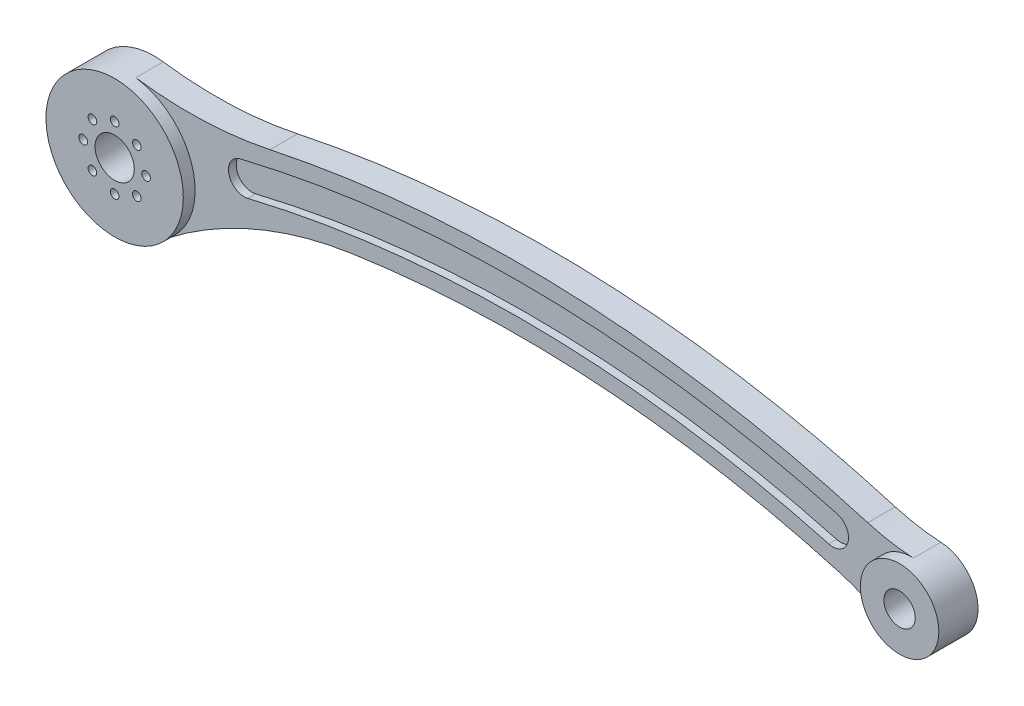
ISO-10303-21;
HEADER;
FILE_DESCRIPTION(('STEP AP214'),'2;1');
FILE_NAME('part.step','',(''),(''),'','','');
FILE_SCHEMA(('AUTOMOTIVE_DESIGN { 1 0 10303 214 1 1 1 1 }'));
ENDSEC;
DATA;
#1=APPLICATION_CONTEXT('core data for automotive mechanical design processes');
#2=APPLICATION_PROTOCOL_DEFINITION('international standard','automotive_design',2000,#1);
#3=PRODUCT_CONTEXT('',#1,'mechanical');
#4=PRODUCT('Part','Part','',(#3));
#5=PRODUCT_RELATED_PRODUCT_CATEGORY('part','',(#4));
#6=PRODUCT_DEFINITION_FORMATION('','',#4);
#7=PRODUCT_DEFINITION_CONTEXT('part definition',#1,'design');
#8=PRODUCT_DEFINITION('design','',#6,#7);
#9=PRODUCT_DEFINITION_SHAPE('','',#8);
#10=(LENGTH_UNIT() NAMED_UNIT(*) SI_UNIT(.MILLI.,.METRE.));
#11=(NAMED_UNIT(*) PLANE_ANGLE_UNIT() SI_UNIT($,.RADIAN.));
#12=(NAMED_UNIT(*) SI_UNIT($,.STERADIAN.) SOLID_ANGLE_UNIT());
#13=UNCERTAINTY_MEASURE_WITH_UNIT(LENGTH_MEASURE(1.E-05),#10,'distance_accuracy_value','');
#14=(GEOMETRIC_REPRESENTATION_CONTEXT(3) GLOBAL_UNCERTAINTY_ASSIGNED_CONTEXT((#13)) GLOBAL_UNIT_ASSIGNED_CONTEXT((#10,
#11,#12)) REPRESENTATION_CONTEXT('',''));
#15=CARTESIAN_POINT('',(0.,0.,0.));
#16=DIRECTION('',(0.,0.,1.));
#17=DIRECTION('',(1.,0.,0.));
#18=AXIS2_PLACEMENT_3D('',#15,#16,#17);
#19=CARTESIAN_POINT('',(150.30166314964,-142.163321762162,10.));
#20=DIRECTION('',(0.,0.,-1.));
#21=DIRECTION('',(-1.,0.,0.));
#22=AXIS2_PLACEMENT_3D('',#19,#20,#21);
#23=PLANE('',#22);
#24=CARTESIAN_POINT('',(0.,8.,10.));
#25=DIRECTION('',(0.,0.,1.));
#26=DIRECTION('',(1.,0.,0.));
#27=AXIS2_PLACEMENT_3D('',#24,#25,#26);
#28=CIRCLE('',#27,1.09999999999999);
#29=CARTESIAN_POINT('',(1.09999999999999,8.,10.));
#30=VERTEX_POINT('',#29);
#31=EDGE_CURVE('E361',#30,#30,#28,.T.);
#32=ORIENTED_EDGE('',*,*,#31,.F.);
#33=EDGE_LOOP('',(#32));
#34=FACE_BOUND('',#33,.T.);
#35=CARTESIAN_POINT('',(5.65685424949248,5.65685424949262,10.));
#36=DIRECTION('',(0.,0.,1.));
#37=DIRECTION('',(1.,0.,0.));
#38=AXIS2_PLACEMENT_3D('',#35,#36,#37);
#39=CIRCLE('',#38,1.09999999999999);
#40=CARTESIAN_POINT('',(6.75685424949247,5.65685424949262,10.));
#41=VERTEX_POINT('',#40);
#42=EDGE_CURVE('E353',#41,#41,#39,.T.);
#43=ORIENTED_EDGE('',*,*,#42,.F.);
#44=EDGE_LOOP('',(#43));
#45=FACE_BOUND('',#44,.T.);
#46=CARTESIAN_POINT('',(8.00000000000034,3.39590937005871E-13,10.));
#47=DIRECTION('',(0.,0.,1.));
#48=DIRECTION('',(1.,0.,0.));
#49=AXIS2_PLACEMENT_3D('',#46,#47,#48);
#50=CIRCLE('',#49,1.09999999999999);
#51=CARTESIAN_POINT('',(9.10000000000033,3.39590937005871E-13,10.));
#52=VERTEX_POINT('',#51);
#53=EDGE_CURVE('E345',#52,#52,#50,.T.);
#54=ORIENTED_EDGE('',*,*,#53,.F.);
#55=EDGE_LOOP('',(#54));
#56=FACE_BOUND('',#55,.T.);
#57=CARTESIAN_POINT('',(6.79181874011743E-13,-8.,10.));
#58=DIRECTION('',(0.,0.,1.));
#59=DIRECTION('',(1.,0.,0.));
#60=AXIS2_PLACEMENT_3D('',#57,#58,#59);
#61=CIRCLE('',#60,1.09999999999999);
#62=CARTESIAN_POINT('',(1.10000000000067,-8.,10.));
#63=VERTEX_POINT('',#62);
#64=EDGE_CURVE('E329',#63,#63,#61,.T.);
#65=ORIENTED_EDGE('',*,*,#64,.F.);
#66=EDGE_LOOP('',(#65));
#67=FACE_BOUND('',#66,.T.);
#68=CARTESIAN_POINT('',(-5.6568542494918,-5.65685424949262,10.));
#69=DIRECTION('',(0.,0.,1.));
#70=DIRECTION('',(1.,0.,0.));
#71=AXIS2_PLACEMENT_3D('',#68,#69,#70);
#72=CIRCLE('',#71,1.09999999999999);
#73=CARTESIAN_POINT('',(-4.55685424949181,-5.65685424949262,10.));
#74=VERTEX_POINT('',#73);
#75=EDGE_CURVE('E321',#74,#74,#72,.T.);
#76=ORIENTED_EDGE('',*,*,#75,.F.);
#77=EDGE_LOOP('',(#76));
#78=FACE_BOUND('',#77,.T.);
#79=CARTESIAN_POINT('',(-7.99999999999966,-3.40570654445189E-13,10.));
#80=DIRECTION('',(0.,0.,1.));
#81=DIRECTION('',(1.,0.,0.));
#82=AXIS2_PLACEMENT_3D('',#79,#80,#81);
#83=CIRCLE('',#82,1.09999999999999);
#84=CARTESIAN_POINT('',(-6.89999999999967,-3.40570654445189E-13,10.));
#85=VERTEX_POINT('',#84);
#86=EDGE_CURVE('E313',#85,#85,#83,.T.);
#87=ORIENTED_EDGE('',*,*,#86,.F.);
#88=EDGE_LOOP('',(#87));
#89=FACE_BOUND('',#88,.T.);
#90=CARTESIAN_POINT('',(-5.65685424949228,5.65685424949214,10.));
#91=DIRECTION('',(0.,0.,1.));
#92=DIRECTION('',(1.,0.,0.));
#93=AXIS2_PLACEMENT_3D('',#90,#91,#92);
#94=CIRCLE('',#93,1.09999999999999);
#95=CARTESIAN_POINT('',(-4.55685424949229,5.65685424949214,10.));
#96=VERTEX_POINT('',#95);
#97=EDGE_CURVE('E306',#96,#96,#94,.T.);
#98=ORIENTED_EDGE('',*,*,#97,.F.);
#99=EDGE_LOOP('',(#98));
#100=FACE_BOUND('',#99,.T.);
#101=CARTESIAN_POINT('',(0.,0.,10.));
#102=DIRECTION('',(0.,0.,1.));
#103=DIRECTION('',(1.,0.,0.));
#104=AXIS2_PLACEMENT_3D('',#101,#102,#103);
#105=CIRCLE('',#104,5.);
#106=CARTESIAN_POINT('',(5.,0.,10.));
#107=VERTEX_POINT('',#106);
#108=EDGE_CURVE('E242',#107,#107,#105,.T.);
#109=ORIENTED_EDGE('',*,*,#108,.F.);
#110=EDGE_LOOP('',(#109));
#111=FACE_BOUND('',#110,.T.);
#112=CARTESIAN_POINT('',(0.,0.,10.));
#113=DIRECTION('',(0.,0.,1.));
#114=DIRECTION('',(1.,0.,0.));
#115=AXIS2_PLACEMENT_3D('',#112,#113,#114);
#116=CIRCLE('',#115,17.5);
#117=CARTESIAN_POINT('',(17.5,0.,10.));
#118=VERTEX_POINT('',#117);
#119=EDGE_CURVE('E185',#118,#118,#116,.T.);
#120=ORIENTED_EDGE('',*,*,#119,.T.);
#121=EDGE_LOOP('',(#120));
#122=FACE_BOUND('',#121,.T.);
#123=CARTESIAN_POINT('',(5.65685424949296,-5.65685424949214,10.));
#124=DIRECTION('',(0.,0.,1.));
#125=DIRECTION('',(1.,0.,0.));
#126=AXIS2_PLACEMENT_3D('',#123,#124,#125);
#127=CIRCLE('',#126,1.09999999999999);
#128=CARTESIAN_POINT('',(6.75685424949295,-5.65685424949214,10.));
#129=VERTEX_POINT('',#128);
#130=EDGE_CURVE('E337',#129,#129,#127,.T.);
#131=ORIENTED_EDGE('',*,*,#130,.F.);
#132=EDGE_LOOP('',(#131));
#133=FACE_BOUND('',#132,.T.);
#134=ADVANCED_FACE('F40',(#34,#45,#56,#67,#78,#89,#100,#111,#122,#133),#23,.F.);
#135=CARTESIAN_POINT('',(179.999550740558,6.62602105160044,10.));
#136=DIRECTION('',(0.,0.,-1.));
#137=DIRECTION('',(-1.,0.,0.));
#138=AXIS2_PLACEMENT_3D('',#135,#136,#137);
#139=CYLINDRICAL_SURFACE('',#138,4.);
#140=DIRECTION('',(0.,0.,-1.));
#141=VECTOR('',#140,1.);
#142=CARTESIAN_POINT('',(178.947951069275,2.76672861238847,10.));
#143=LINE('',#142,#141);
#144=CARTESIAN_POINT('',(178.947951069275,2.76672861238847,7.));
#145=VERTEX_POINT('',#144);
#146=CARTESIAN_POINT('',(178.947951069275,2.7667286123885,5.));
#147=VERTEX_POINT('',#146);
#148=EDGE_CURVE('E259',#145,#147,#143,.T.);
#149=ORIENTED_EDGE('',*,*,#148,.F.);
#150=CARTESIAN_POINT('',(179.999550740558,6.62602105160044,7.));
#151=DIRECTION('',(0.,0.,1.));
#152=DIRECTION('',(1.,0.,0.));
#153=AXIS2_PLACEMENT_3D('',#150,#151,#152);
#154=CIRCLE('',#153,4.);
#155=CARTESIAN_POINT('',(181.05115041184,10.4853134908123,7.));
#156=VERTEX_POINT('',#155);
#157=EDGE_CURVE('E56',#145,#156,#154,.T.);
#158=ORIENTED_EDGE('',*,*,#157,.T.);
#159=DIRECTION('',(0.,0.,-1.));
#160=VECTOR('',#159,1.);
#161=CARTESIAN_POINT('',(181.05115041184,10.4853134908123,10.));
#162=LINE('',#161,#160);
#163=CARTESIAN_POINT('',(181.05115041184,10.4853134908123,5.));
#164=VERTEX_POINT('',#163);
#165=EDGE_CURVE('E248',#156,#164,#162,.T.);
#166=ORIENTED_EDGE('',*,*,#165,.T.);
#167=CARTESIAN_POINT('',(179.999550740558,6.62602105160044,5.));
#168=DIRECTION('',(0.,0.,-1.));
#169=DIRECTION('',(-1.,0.,0.));
#170=AXIS2_PLACEMENT_3D('',#167,#168,#169);
#171=CIRCLE('',#170,4.);
#172=EDGE_CURVE('E261',#164,#147,#171,.T.);
#173=ORIENTED_EDGE('',*,*,#172,.T.);
#174=EDGE_LOOP('',(#149,#158,#166,#173));
#175=FACE_BOUND('',#174,.T.);
#176=ADVANCED_FACE('F371',(#175),#139,.F.);
#177=CARTESIAN_POINT('',(100.603775558723,-284.7505581089,10.));
#178=DIRECTION('',(0.,0.,-1.));
#179=DIRECTION('',(-1.,0.,0.));
#180=AXIS2_PLACEMENT_3D('',#177,#178,#179);
#181=CYLINDRICAL_SURFACE('',#180,306.);
#182=ORIENTED_EDGE('',*,*,#165,.F.);
#183=CARTESIAN_POINT('',(100.603775558723,-284.7505581089,7.));
#184=DIRECTION('',(0.,0.,1.));
#185=DIRECTION('',(1.,0.,0.));
#186=AXIS2_PLACEMENT_3D('',#183,#184,#185);
#187=CIRCLE('',#186,306.);
#188=CARTESIAN_POINT('',(29.0648506548514,12.7694953725386,7.));
#189=VERTEX_POINT('',#188);
#190=EDGE_CURVE('E279',#156,#189,#187,.T.);
#191=ORIENTED_EDGE('',*,*,#190,.T.);
#192=DIRECTION('',(0.,0.,-1.));
#193=VECTOR('',#192,1.);
#194=CARTESIAN_POINT('',(29.0648506548514,12.7694953725386,10.));
#195=LINE('',#194,#193);
#196=CARTESIAN_POINT('',(29.0648506548514,12.7694953725386,5.));
#197=VERTEX_POINT('',#196);
#198=EDGE_CURVE('E253',#189,#197,#195,.T.);
#199=ORIENTED_EDGE('',*,*,#198,.T.);
#200=CARTESIAN_POINT('',(100.603775558723,-284.7505581089,5.));
#201=DIRECTION('',(0.,0.,-1.));
#202=DIRECTION('',(-1.,0.,0.));
#203=AXIS2_PLACEMENT_3D('',#200,#201,#202);
#204=CIRCLE('',#203,306.);
#205=EDGE_CURVE('E265',#197,#164,#204,.T.);
#206=ORIENTED_EDGE('',*,*,#205,.T.);
#207=EDGE_LOOP('',(#182,#191,#199,#206));
#208=FACE_BOUND('',#207,.T.);
#209=ADVANCED_FACE('F635',(#208),#181,.F.);
#210=CARTESIAN_POINT('',(30.,8.88034434663747,10.));
#211=DIRECTION('',(0.,0.,-1.));
#212=DIRECTION('',(-1.,0.,0.));
#213=AXIS2_PLACEMENT_3D('',#210,#211,#212);
#214=CYLINDRICAL_SURFACE('',#213,3.99999999999999);
#215=ORIENTED_EDGE('',*,*,#198,.F.);
#216=CARTESIAN_POINT('',(30.,8.88034434663747,7.));
#217=DIRECTION('',(0.,0.,1.));
#218=DIRECTION('',(1.,0.,0.));
#219=AXIS2_PLACEMENT_3D('',#216,#217,#218);
#220=CIRCLE('',#219,3.99999999999999);
#221=CARTESIAN_POINT('',(30.9351493451486,4.99119332073633,7.));
#222=VERTEX_POINT('',#221);
#223=EDGE_CURVE('E282',#189,#222,#220,.T.);
#224=ORIENTED_EDGE('',*,*,#223,.T.);
#225=DIRECTION('',(0.,0.,-1.));
#226=VECTOR('',#225,1.);
#227=CARTESIAN_POINT('',(30.9351493451486,4.99119332073633,10.));
#228=LINE('',#227,#226);
#229=CARTESIAN_POINT('',(30.9351493451486,4.99119332073633,5.));
#230=VERTEX_POINT('',#229);
#231=EDGE_CURVE('E256',#222,#230,#228,.T.);
#232=ORIENTED_EDGE('',*,*,#231,.T.);
#233=CARTESIAN_POINT('',(30.,8.88034434663747,5.));
#234=DIRECTION('',(0.,0.,-1.));
#235=DIRECTION('',(-1.,0.,0.));
#236=AXIS2_PLACEMENT_3D('',#233,#234,#235);
#237=CIRCLE('',#236,3.99999999999998);
#238=EDGE_CURVE('E269',#230,#197,#237,.T.);
#239=ORIENTED_EDGE('',*,*,#238,.T.);
#240=EDGE_LOOP('',(#215,#224,#232,#239));
#241=FACE_BOUND('',#240,.T.);
#242=ADVANCED_FACE('F625',(#241),#214,.F.);
#243=CARTESIAN_POINT('',(100.603775558723,-284.7505581089,10.));
#244=DIRECTION('',(0.,0.,-1.));
#245=DIRECTION('',(-1.,0.,0.));
#246=AXIS2_PLACEMENT_3D('',#243,#244,#245);
#247=CYLINDRICAL_SURFACE('',#246,298.);
#248=ORIENTED_EDGE('',*,*,#231,.F.);
#249=CARTESIAN_POINT('',(100.603775558723,-284.7505581089,7.));
#250=DIRECTION('',(0.,0.,1.));
#251=DIRECTION('',(1.,0.,0.));
#252=AXIS2_PLACEMENT_3D('',#249,#250,#251);
#253=CIRCLE('',#252,298.);
#254=EDGE_CURVE('E286',#222,#145,#253,.F.);
#255=ORIENTED_EDGE('',*,*,#254,.T.);
#256=ORIENTED_EDGE('',*,*,#148,.T.);
#257=CARTESIAN_POINT('',(100.603775558723,-284.7505581089,5.));
#258=DIRECTION('',(0.,0.,1.));
#259=DIRECTION('',(-1.,0.,0.));
#260=AXIS2_PLACEMENT_3D('',#257,#258,#259);
#261=CIRCLE('',#260,298.);
#262=EDGE_CURVE('E273',#147,#230,#261,.T.);
#263=ORIENTED_EDGE('',*,*,#262,.T.);
#264=EDGE_LOOP('',(#248,#255,#256,#263));
#265=FACE_BOUND('',#264,.T.);
#266=ADVANCED_FACE('F620',(#265),#247,.T.);
#267=CARTESIAN_POINT('',(140.30166314964,-139.06226852865,5.));
#268=DIRECTION('',(0.,0.,-1.));
#269=DIRECTION('',(-1.,0.,0.));
#270=AXIS2_PLACEMENT_3D('',#267,#268,#269);
#271=PLANE('',#270);
#272=ORIENTED_EDGE('',*,*,#262,.F.);
#273=ORIENTED_EDGE('',*,*,#172,.F.);
#274=ORIENTED_EDGE('',*,*,#205,.F.);
#275=ORIENTED_EDGE('',*,*,#238,.F.);
#276=EDGE_LOOP('',(#272,#273,#274,#275));
#277=FACE_BOUND('',#276,.T.);
#278=ADVANCED_FACE('F613',(#277),#271,.F.);
#279=CARTESIAN_POINT('',(134.175744006113,-167.460648335862,7.));
#280=DIRECTION('',(0.,0.,1.));
#281=DIRECTION('',(1.,0.,0.));
#282=AXIS2_PLACEMENT_3D('',#279,#280,#281);
#283=PLANE('',#282);
#284=ORIENTED_EDGE('',*,*,#254,.F.);
#285=ORIENTED_EDGE('',*,*,#223,.F.);
#286=ORIENTED_EDGE('',*,*,#190,.F.);
#287=ORIENTED_EDGE('',*,*,#157,.F.);
#288=EDGE_LOOP('',(#284,#285,#286,#287));
#289=FACE_BOUND('',#288,.T.);
#290=CARTESIAN_POINT('',(167.747712453503,-50.1707385628238,7.));
#291=DIRECTION('',(0.,0.,-1.));
#292=DIRECTION('',(1.,0.,0.));
#293=AXIS2_PLACEMENT_3D('',#290,#291,#292);
#294=CIRCLE('',#293,50.);
#295=CARTESIAN_POINT('',(181.506715915548,-2.10110340993941,7.));
#296=VERTEX_POINT('',#295);
#297=CARTESIAN_POINT('',(194.624244359382,-8.00852760665749,7.));
#298=VERTEX_POINT('',#297);
#299=EDGE_CURVE('E138',#296,#298,#294,.T.);
#300=ORIENTED_EDGE('',*,*,#299,.T.);
#301=CARTESIAN_POINT('',(199.999550740558,0.423914584575795,7.));
#302=DIRECTION('',(0.,0.,-1.));
#303=DIRECTION('',(1.,0.,0.));
#304=AXIS2_PLACEMENT_3D('',#301,#302,#303);
#305=CIRCLE('',#304,10.);
#306=CARTESIAN_POINT('',(200.520666376203,10.4103272785459,7.));
#307=VERTEX_POINT('',#306);
#308=EDGE_CURVE('E64',#298,#307,#305,.T.);
#309=ORIENTED_EDGE('',*,*,#308,.T.);
#310=CARTESIAN_POINT('',(203.12624455443,60.3423907483957,7.));
#311=DIRECTION('',(0.,0.,-1.));
#312=DIRECTION('',(1.,0.,0.));
#313=AXIS2_PLACEMENT_3D('',#310,#311,#312);
#314=CIRCLE('',#313,49.9999999999997);
#315=CARTESIAN_POINT('',(188.887012749471,12.412814518216,7.));
#316=VERTEX_POINT('',#315);
#317=EDGE_CURVE('E137',#307,#316,#314,.T.);
#318=ORIENTED_EDGE('',*,*,#317,.T.);
#319=CARTESIAN_POINT('',(100.603775558723,-284.7505581089,7.));
#320=DIRECTION('',(0.,0.,1.));
#321=DIRECTION('',(1.,0.,0.));
#322=AXIS2_PLACEMENT_3D('',#319,#320,#321);
#323=CIRCLE('',#322,310.);
#324=CARTESIAN_POINT('',(36.5918000330634,18.5685263373352,7.));
#325=VERTEX_POINT('',#324);
#326=EDGE_CURVE('E223',#316,#325,#323,.T.);
#327=ORIENTED_EDGE('',*,*,#326,.T.);
#328=CARTESIAN_POINT('',(15.9427756699475,116.413392287734,7.));
#329=DIRECTION('',(0.,0.,-1.));
#330=DIRECTION('',(1.,0.,0.));
#331=AXIS2_PLACEMENT_3D('',#328,#329,#330);
#332=CIRCLE('',#331,100.);
#333=CARTESIAN_POINT('',(2.37445595084322,17.3381648088114,7.));
#334=VERTEX_POINT('',#333);
#335=EDGE_CURVE('E219',#325,#334,#332,.T.);
#336=ORIENTED_EDGE('',*,*,#335,.T.);
#337=CARTESIAN_POINT('',(0.,0.,7.));
#338=DIRECTION('',(0.,0.,-1.));
#339=DIRECTION('',(1.,0.,0.));
#340=AXIS2_PLACEMENT_3D('',#337,#338,#339);
#341=CIRCLE('',#340,17.5);
#342=CARTESIAN_POINT('',(10.7198895078001,-13.8323522562346,7.));
#343=VERTEX_POINT('',#342);
#344=EDGE_CURVE('E294',#334,#343,#341,.T.);
#345=ORIENTED_EDGE('',*,*,#344,.T.);
#346=CARTESIAN_POINT('',(71.9764009809434,-92.8743651490036,7.));
#347=DIRECTION('',(0.,0.,-1.));
#348=DIRECTION('',(1.,0.,0.));
#349=AXIS2_PLACEMENT_3D('',#346,#347,#348);
#350=CIRCLE('',#349,99.9999999999999);
#351=CARTESIAN_POINT('',(57.2200223326035,6.03088895403593,7.));
#352=VERTEX_POINT('',#351);
#353=EDGE_CURVE('E291',#343,#352,#350,.T.);
#354=ORIENTED_EDGE('',*,*,#353,.T.);
#355=CARTESIAN_POINT('',(100.603775558723,-284.7505581089,7.));
#356=DIRECTION('',(0.,0.,-1.));
#357=DIRECTION('',(1.,0.,0.));
#358=AXIS2_PLACEMENT_3D('',#355,#356,#357);
#359=CIRCLE('',#358,294.);
#360=EDGE_CURVE('E143',#352,#296,#359,.T.);
#361=ORIENTED_EDGE('',*,*,#360,.T.);
#362=EDGE_LOOP('',(#300,#309,#318,#327,#336,#345,#354,#361));
#363=FACE_BOUND('',#362,.T.);
#364=ADVANCED_FACE('F141',(#289,#363),#283,.T.);
#365=CARTESIAN_POINT('',(0.,0.,10.));
#366=DIRECTION('',(0.,0.,-1.));
#367=DIRECTION('',(-1.,0.,0.));
#368=AXIS2_PLACEMENT_3D('',#365,#366,#367);
#369=CYLINDRICAL_SURFACE('',#368,5.);
#370=ORIENTED_EDGE('',*,*,#108,.T.);
#371=EDGE_LOOP('',(#370));
#372=FACE_BOUND('',#371,.T.);
#373=CARTESIAN_POINT('',(0.,0.,0.));
#374=DIRECTION('',(0.,0.,1.));
#375=DIRECTION('',(1.,0.,0.));
#376=AXIS2_PLACEMENT_3D('',#373,#374,#375);
#377=CIRCLE('',#376,5.);
#378=CARTESIAN_POINT('',(5.,0.,0.));
#379=VERTEX_POINT('',#378);
#380=EDGE_CURVE('E244',#379,#379,#377,.T.);
#381=ORIENTED_EDGE('',*,*,#380,.F.);
#382=EDGE_LOOP('',(#381));
#383=FACE_BOUND('',#382,.T.);
#384=ADVANCED_FACE('F416',(#372,#383),#369,.F.);
#385=CARTESIAN_POINT('',(199.999550740558,0.423914584575795,10.));
#386=DIRECTION('',(0.,0.,-1.));
#387=DIRECTION('',(-1.,0.,0.));
#388=AXIS2_PLACEMENT_3D('',#385,#386,#387);
#389=CYLINDRICAL_SURFACE('',#388,3.99999999999999);
#390=CARTESIAN_POINT('',(199.999550740558,0.423914584575795,10.));
#391=DIRECTION('',(0.,0.,1.));
#392=DIRECTION('',(1.,0.,0.));
#393=AXIS2_PLACEMENT_3D('',#390,#391,#392);
#394=CIRCLE('',#393,3.99999999999999);
#395=CARTESIAN_POINT('',(203.999550740558,0.423914584575795,10.));
#396=VERTEX_POINT('',#395);
#397=EDGE_CURVE('E227',#396,#396,#394,.T.);
#398=ORIENTED_EDGE('',*,*,#397,.T.);
#399=EDGE_LOOP('',(#398));
#400=FACE_BOUND('',#399,.T.);
#401=CARTESIAN_POINT('',(199.999550740558,0.423914584575795,0.));
#402=DIRECTION('',(0.,0.,1.));
#403=DIRECTION('',(1.,0.,0.));
#404=AXIS2_PLACEMENT_3D('',#401,#402,#403);
#405=CIRCLE('',#404,3.99999999999999);
#406=CARTESIAN_POINT('',(203.999550740558,0.423914584575795,0.));
#407=VERTEX_POINT('',#406);
#408=EDGE_CURVE('E231',#407,#407,#405,.T.);
#409=ORIENTED_EDGE('',*,*,#408,.F.);
#410=EDGE_LOOP('',(#409));
#411=FACE_BOUND('',#410,.T.);
#412=ADVANCED_FACE('F402',(#400,#411),#389,.F.);
#413=CARTESIAN_POINT('',(150.30166314964,-142.163321762162,0.));
#414=DIRECTION('',(0.,0.,-1.));
#415=DIRECTION('',(-1.,0.,0.));
#416=AXIS2_PLACEMENT_3D('',#413,#414,#415);
#417=PLANE('',#416);
#418=CARTESIAN_POINT('',(0.,8.,0.));
#419=DIRECTION('',(0.,0.,-1.));
#420=DIRECTION('',(-1.,0.,0.));
#421=AXIS2_PLACEMENT_3D('',#418,#419,#420);
#422=CIRCLE('',#421,1.09999999999999);
#423=CARTESIAN_POINT('',(-1.09999999999999,8.,0.));
#424=VERTEX_POINT('',#423);
#425=EDGE_CURVE('E357',#424,#424,#422,.T.);
#426=ORIENTED_EDGE('',*,*,#425,.F.);
#427=EDGE_LOOP('',(#426));
#428=FACE_BOUND('',#427,.T.);
#429=CARTESIAN_POINT('',(5.65685424949248,5.65685424949262,0.));
#430=DIRECTION('',(0.,0.,-1.));
#431=DIRECTION('',(-1.,0.,0.));
#432=AXIS2_PLACEMENT_3D('',#429,#430,#431);
#433=CIRCLE('',#432,1.09999999999999);
#434=CARTESIAN_POINT('',(4.55685424949249,5.65685424949262,0.));
#435=VERTEX_POINT('',#434);
#436=EDGE_CURVE('E349',#435,#435,#433,.T.);
#437=ORIENTED_EDGE('',*,*,#436,.F.);
#438=EDGE_LOOP('',(#437));
#439=FACE_BOUND('',#438,.T.);
#440=CARTESIAN_POINT('',(8.00000000000034,3.39590937005871E-13,0.));
#441=DIRECTION('',(0.,0.,-1.));
#442=DIRECTION('',(-1.,0.,0.));
#443=AXIS2_PLACEMENT_3D('',#440,#441,#442);
#444=CIRCLE('',#443,1.09999999999999);
#445=CARTESIAN_POINT('',(6.90000000000035,3.39590937005871E-13,0.));
#446=VERTEX_POINT('',#445);
#447=EDGE_CURVE('E341',#446,#446,#444,.T.);
#448=ORIENTED_EDGE('',*,*,#447,.F.);
#449=EDGE_LOOP('',(#448));
#450=FACE_BOUND('',#449,.T.);
#451=CARTESIAN_POINT('',(5.65685424949296,-5.65685424949214,0.));
#452=DIRECTION('',(0.,0.,-1.));
#453=DIRECTION('',(-1.,0.,0.));
#454=AXIS2_PLACEMENT_3D('',#451,#452,#453);
#455=CIRCLE('',#454,1.09999999999999);
#456=CARTESIAN_POINT('',(4.55685424949297,-5.65685424949214,0.));
#457=VERTEX_POINT('',#456);
#458=EDGE_CURVE('E333',#457,#457,#455,.T.);
#459=ORIENTED_EDGE('',*,*,#458,.F.);
#460=EDGE_LOOP('',(#459));
#461=FACE_BOUND('',#460,.T.);
#462=CARTESIAN_POINT('',(6.79181874011743E-13,-8.,0.));
#463=DIRECTION('',(0.,0.,-1.));
#464=DIRECTION('',(-1.,0.,0.));
#465=AXIS2_PLACEMENT_3D('',#462,#463,#464);
#466=CIRCLE('',#465,1.09999999999999);
#467=CARTESIAN_POINT('',(-1.09999999999931,-8.,0.));
#468=VERTEX_POINT('',#467);
#469=EDGE_CURVE('E325',#468,#468,#466,.T.);
#470=ORIENTED_EDGE('',*,*,#469,.F.);
#471=EDGE_LOOP('',(#470));
#472=FACE_BOUND('',#471,.T.);
#473=CARTESIAN_POINT('',(-5.6568542494918,-5.65685424949262,0.));
#474=DIRECTION('',(0.,0.,-1.));
#475=DIRECTION('',(-1.,0.,0.));
#476=AXIS2_PLACEMENT_3D('',#473,#474,#475);
#477=CIRCLE('',#476,1.09999999999999);
#478=CARTESIAN_POINT('',(-6.75685424949179,-5.65685424949262,0.));
#479=VERTEX_POINT('',#478);
#480=EDGE_CURVE('E317',#479,#479,#477,.T.);
#481=ORIENTED_EDGE('',*,*,#480,.F.);
#482=EDGE_LOOP('',(#481));
#483=FACE_BOUND('',#482,.T.);
#484=CARTESIAN_POINT('',(-7.99999999999966,-3.40570654445189E-13,0.));
#485=DIRECTION('',(0.,0.,-1.));
#486=DIRECTION('',(-1.,0.,0.));
#487=AXIS2_PLACEMENT_3D('',#484,#485,#486);
#488=CIRCLE('',#487,1.09999999999999);
#489=CARTESIAN_POINT('',(-9.09999999999966,-3.40570654445189E-13,0.));
#490=VERTEX_POINT('',#489);
#491=EDGE_CURVE('E310',#490,#490,#488,.T.);
#492=ORIENTED_EDGE('',*,*,#491,.F.);
#493=EDGE_LOOP('',(#492));
#494=FACE_BOUND('',#493,.T.);
#495=CARTESIAN_POINT('',(-5.65685424949228,5.65685424949214,0.));
#496=DIRECTION('',(0.,0.,-1.));
#497=DIRECTION('',(-1.,0.,0.));
#498=AXIS2_PLACEMENT_3D('',#495,#496,#497);
#499=CIRCLE('',#498,1.09999999999999);
#500=CARTESIAN_POINT('',(-6.75685424949227,5.65685424949214,0.));
#501=VERTEX_POINT('',#500);
#502=EDGE_CURVE('E148',#501,#501,#499,.T.);
#503=ORIENTED_EDGE('',*,*,#502,.F.);
#504=EDGE_LOOP('',(#503));
#505=FACE_BOUND('',#504,.T.);
#506=ORIENTED_EDGE('',*,*,#408,.T.);
#507=EDGE_LOOP('',(#506));
#508=FACE_BOUND('',#507,.T.);
#509=CARTESIAN_POINT('',(100.603775558723,-284.7505581089,0.));
#510=DIRECTION('',(0.,0.,1.));
#511=DIRECTION('',(-1.,0.,0.));
#512=AXIS2_PLACEMENT_3D('',#509,#510,#511);
#513=CIRCLE('',#512,310.);
#514=CARTESIAN_POINT('',(188.887012749471,12.4128145182157,0.));
#515=VERTEX_POINT('',#514);
#516=CARTESIAN_POINT('',(36.5918000330634,18.5685263373351,0.));
#517=VERTEX_POINT('',#516);
#518=EDGE_CURVE('E189',#515,#517,#513,.T.);
#519=ORIENTED_EDGE('',*,*,#518,.F.);
#520=CARTESIAN_POINT('',(203.12624455443,60.3423907483957,0.));
#521=DIRECTION('',(0.,0.,-1.));
#522=DIRECTION('',(-1.,0.,0.));
#523=AXIS2_PLACEMENT_3D('',#520,#521,#522);
#524=CIRCLE('',#523,50.);
#525=CARTESIAN_POINT('',(200.520666376203,10.4103272785459,0.));
#526=VERTEX_POINT('',#525);
#527=EDGE_CURVE('E11',#515,#526,#524,.F.);
#528=ORIENTED_EDGE('',*,*,#527,.T.);
#529=CARTESIAN_POINT('',(199.999550740558,0.423914584575795,0.));
#530=DIRECTION('',(0.,0.,1.));
#531=DIRECTION('',(1.,0.,0.));
#532=AXIS2_PLACEMENT_3D('',#529,#530,#531);
#533=CIRCLE('',#532,10.);
#534=CARTESIAN_POINT('',(194.624244359382,-8.0085276066575,0.));
#535=VERTEX_POINT('',#534);
#536=EDGE_CURVE('E175',#535,#526,#533,.T.);
#537=ORIENTED_EDGE('',*,*,#536,.F.);
#538=CARTESIAN_POINT('',(167.747712453503,-50.1707385628238,0.));
#539=DIRECTION('',(0.,0.,-1.));
#540=DIRECTION('',(-1.,0.,0.));
#541=AXIS2_PLACEMENT_3D('',#538,#539,#540);
#542=CIRCLE('',#541,50.);
#543=CARTESIAN_POINT('',(181.506715915548,-2.10110340993935,0.));
#544=VERTEX_POINT('',#543);
#545=EDGE_CURVE('E49',#535,#544,#542,.F.);
#546=ORIENTED_EDGE('',*,*,#545,.T.);
#547=CARTESIAN_POINT('',(100.603775558723,-284.7505581089,0.));
#548=DIRECTION('',(0.,0.,-1.));
#549=DIRECTION('',(-1.,0.,0.));
#550=AXIS2_PLACEMENT_3D('',#547,#548,#549);
#551=CIRCLE('',#550,294.);
#552=CARTESIAN_POINT('',(57.2200223326035,6.03088895403603,0.));
#553=VERTEX_POINT('',#552);
#554=EDGE_CURVE('E174',#553,#544,#551,.T.);
#555=ORIENTED_EDGE('',*,*,#554,.F.);
#556=CARTESIAN_POINT('',(71.9764009809434,-92.8743651490036,0.));
#557=DIRECTION('',(0.,0.,-1.));
#558=DIRECTION('',(-1.,0.,0.));
#559=AXIS2_PLACEMENT_3D('',#556,#557,#558);
#560=CIRCLE('',#559,100.);
#561=CARTESIAN_POINT('',(10.7198895078001,-13.8323522562346,0.));
#562=VERTEX_POINT('',#561);
#563=EDGE_CURVE('E207',#553,#562,#560,.F.);
#564=ORIENTED_EDGE('',*,*,#563,.T.);
#565=CARTESIAN_POINT('',(0.,0.,0.));
#566=DIRECTION('',(0.,0.,1.));
#567=DIRECTION('',(1.,0.,0.));
#568=AXIS2_PLACEMENT_3D('',#565,#566,#567);
#569=CIRCLE('',#568,17.5);
#570=CARTESIAN_POINT('',(2.37445595084325,17.3381648088114,0.));
#571=VERTEX_POINT('',#570);
#572=EDGE_CURVE('E181',#571,#562,#569,.T.);
#573=ORIENTED_EDGE('',*,*,#572,.F.);
#574=CARTESIAN_POINT('',(15.9427756699475,116.413392287734,0.));
#575=DIRECTION('',(0.,0.,-1.));
#576=DIRECTION('',(-1.,0.,0.));
#577=AXIS2_PLACEMENT_3D('',#574,#575,#576);
#578=CIRCLE('',#577,100.);
#579=EDGE_CURVE('E160',#571,#517,#578,.F.);
#580=ORIENTED_EDGE('',*,*,#579,.T.);
#581=EDGE_LOOP('',(#519,#528,#537,#546,#555,#564,#573,#580));
#582=FACE_BOUND('',#581,.T.);
#583=ORIENTED_EDGE('',*,*,#380,.T.);
#584=EDGE_LOOP('',(#583));
#585=FACE_BOUND('',#584,.T.);
#586=ADVANCED_FACE('F172',(#428,#439,#450,#461,#472,#483,#494,#505,#508,#582,#585),#417,.T.);
#587=CARTESIAN_POINT('',(203.12624455443,60.3423907483957,10.));
#588=DIRECTION('',(0.,0.,1.));
#589=DIRECTION('',(1.,0.,0.));
#590=AXIS2_PLACEMENT_3D('',#587,#588,#589);
#591=CYLINDRICAL_SURFACE('',#590,50.);
#592=ORIENTED_EDGE('',*,*,#317,.F.);
#593=DIRECTION('',(0.,0.,-1.));
#594=VECTOR('',#593,1.);
#595=CARTESIAN_POINT('',(200.520666376203,10.4103272785459,10.));
#596=LINE('',#595,#594);
#597=EDGE_CURVE('E135',#526,#307,#596,.F.);
#598=ORIENTED_EDGE('',*,*,#597,.F.);
#599=ORIENTED_EDGE('',*,*,#527,.F.);
#600=DIRECTION('',(0.,0.,-1.));
#601=VECTOR('',#600,1.);
#602=CARTESIAN_POINT('',(188.887012749471,12.4128145182157,10.));
#603=LINE('',#602,#601);
#604=EDGE_CURVE('E157',#316,#515,#603,.T.);
#605=ORIENTED_EDGE('',*,*,#604,.F.);
#606=EDGE_LOOP('',(#592,#598,#599,#605));
#607=FACE_BOUND('',#606,.T.);
#608=ADVANCED_FACE('F42',(#607),#591,.F.);
#609=CARTESIAN_POINT('',(199.999550740558,0.423914584575795,10.));
#610=DIRECTION('',(0.,0.,-1.));
#611=DIRECTION('',(-1.,0.,0.));
#612=AXIS2_PLACEMENT_3D('',#609,#610,#611);
#613=CYLINDRICAL_SURFACE('',#612,10.);
#614=ORIENTED_EDGE('',*,*,#308,.F.);
#615=DIRECTION('',(0.,0.,-1.));
#616=VECTOR('',#615,1.);
#617=CARTESIAN_POINT('',(194.624244359382,-8.00852760665749,10.));
#618=LINE('',#617,#616);
#619=EDGE_CURVE('E132',#298,#535,#618,.T.);
#620=ORIENTED_EDGE('',*,*,#619,.T.);
#621=ORIENTED_EDGE('',*,*,#536,.T.);
#622=ORIENTED_EDGE('',*,*,#597,.T.);
#623=EDGE_LOOP('',(#614,#620,#621,#622));
#624=FACE_BOUND('',#623,.T.);
#625=CARTESIAN_POINT('',(199.999550740558,0.423914584575795,10.));
#626=DIRECTION('',(0.,0.,1.));
#627=DIRECTION('',(1.,0.,0.));
#628=AXIS2_PLACEMENT_3D('',#625,#626,#627);
#629=CIRCLE('',#628,10.);
#630=CARTESIAN_POINT('',(209.999550740558,0.423914584575795,10.));
#631=VERTEX_POINT('',#630);
#632=EDGE_CURVE('E196',#631,#631,#629,.T.);
#633=ORIENTED_EDGE('',*,*,#632,.F.);
#634=EDGE_LOOP('',(#633));
#635=FACE_BOUND('',#634,.T.);
#636=ADVANCED_FACE('F128',(#624,#635),#613,.T.);
#637=CARTESIAN_POINT('',(167.747712453503,-50.1707385628238,10.));
#638=DIRECTION('',(0.,0.,-1.));
#639=DIRECTION('',(-1.,0.,0.));
#640=AXIS2_PLACEMENT_3D('',#637,#638,#639);
#641=CYLINDRICAL_SURFACE('',#640,50.);
#642=ORIENTED_EDGE('',*,*,#299,.F.);
#643=DIRECTION('',(0.,0.,-1.));
#644=VECTOR('',#643,1.);
#645=CARTESIAN_POINT('',(181.506715915548,-2.10110340993935,10.));
#646=LINE('',#645,#644);
#647=EDGE_CURVE('E153',#544,#296,#646,.F.);
#648=ORIENTED_EDGE('',*,*,#647,.F.);
#649=ORIENTED_EDGE('',*,*,#545,.F.);
#650=ORIENTED_EDGE('',*,*,#619,.F.);
#651=EDGE_LOOP('',(#642,#648,#649,#650));
#652=FACE_BOUND('',#651,.T.);
#653=ADVANCED_FACE('F150',(#652),#641,.F.);
#654=CARTESIAN_POINT('',(15.9427756699475,116.413392287734,10.));
#655=DIRECTION('',(0.,0.,1.));
#656=DIRECTION('',(1.,0.,0.));
#657=AXIS2_PLACEMENT_3D('',#654,#655,#656);
#658=CYLINDRICAL_SURFACE('',#657,100.);
#659=ORIENTED_EDGE('',*,*,#335,.F.);
#660=DIRECTION('',(0.,0.,-1.));
#661=VECTOR('',#660,1.);
#662=CARTESIAN_POINT('',(36.5918000330634,18.5685263373351,10.));
#663=LINE('',#662,#661);
#664=EDGE_CURVE('E203',#517,#325,#663,.F.);
#665=ORIENTED_EDGE('',*,*,#664,.F.);
#666=ORIENTED_EDGE('',*,*,#579,.F.);
#667=DIRECTION('',(0.,0.,-1.));
#668=VECTOR('',#667,1.);
#669=CARTESIAN_POINT('',(2.37445595084325,17.3381648088114,10.));
#670=LINE('',#669,#668);
#671=EDGE_CURVE('E195',#334,#571,#670,.T.);
#672=ORIENTED_EDGE('',*,*,#671,.F.);
#673=EDGE_LOOP('',(#659,#665,#666,#672));
#674=FACE_BOUND('',#673,.T.);
#675=ADVANCED_FACE('F217',(#674),#658,.F.);
#676=CARTESIAN_POINT('',(0.,0.,10.));
#677=DIRECTION('',(0.,0.,-1.));
#678=DIRECTION('',(-1.,0.,0.));
#679=AXIS2_PLACEMENT_3D('',#676,#677,#678);
#680=CYLINDRICAL_SURFACE('',#679,17.5);
#681=ORIENTED_EDGE('',*,*,#119,.F.);
#682=EDGE_LOOP('',(#681));
#683=FACE_BOUND('',#682,.T.);
#684=ORIENTED_EDGE('',*,*,#572,.T.);
#685=DIRECTION('',(0.,0.,-1.));
#686=VECTOR('',#685,1.);
#687=CARTESIAN_POINT('',(10.7198895078001,-13.8323522562346,10.));
#688=LINE('',#687,#686);
#689=EDGE_CURVE('E199',#562,#343,#688,.F.);
#690=ORIENTED_EDGE('',*,*,#689,.T.);
#691=ORIENTED_EDGE('',*,*,#344,.F.);
#692=ORIENTED_EDGE('',*,*,#671,.T.);
#693=EDGE_LOOP('',(#684,#690,#691,#692));
#694=FACE_BOUND('',#693,.T.);
#695=ADVANCED_FACE('F431',(#683,#694),#680,.T.);
#696=CARTESIAN_POINT('',(71.9764009809434,-92.8743651490036,10.));
#697=DIRECTION('',(0.,0.,-1.));
#698=DIRECTION('',(-1.,0.,0.));
#699=AXIS2_PLACEMENT_3D('',#696,#697,#698);
#700=CYLINDRICAL_SURFACE('',#699,100.);
#701=ORIENTED_EDGE('',*,*,#353,.F.);
#702=ORIENTED_EDGE('',*,*,#689,.F.);
#703=ORIENTED_EDGE('',*,*,#563,.F.);
#704=DIRECTION('',(0.,0.,-1.));
#705=VECTOR('',#704,1.);
#706=CARTESIAN_POINT('',(57.2200223326035,6.03088895403603,10.));
#707=LINE('',#706,#705);
#708=EDGE_CURVE('E179',#352,#553,#707,.T.);
#709=ORIENTED_EDGE('',*,*,#708,.F.);
#710=EDGE_LOOP('',(#701,#702,#703,#709));
#711=FACE_BOUND('',#710,.T.);
#712=ADVANCED_FACE('F430',(#711),#700,.F.);
#713=CARTESIAN_POINT('',(100.603775558723,-284.7505581089,10.));
#714=DIRECTION('',(0.,0.,-1.));
#715=DIRECTION('',(-1.,0.,0.));
#716=AXIS2_PLACEMENT_3D('',#713,#714,#715);
#717=CYLINDRICAL_SURFACE('',#716,294.);
#718=ORIENTED_EDGE('',*,*,#360,.F.);
#719=ORIENTED_EDGE('',*,*,#708,.T.);
#720=ORIENTED_EDGE('',*,*,#554,.T.);
#721=ORIENTED_EDGE('',*,*,#647,.T.);
#722=EDGE_LOOP('',(#718,#719,#720,#721));
#723=FACE_BOUND('',#722,.T.);
#724=ADVANCED_FACE('F177',(#723),#717,.F.);
#725=CARTESIAN_POINT('',(100.603775558723,-284.7505581089,10.));
#726=DIRECTION('',(0.,0.,-1.));
#727=DIRECTION('',(-1.,0.,0.));
#728=AXIS2_PLACEMENT_3D('',#725,#726,#727);
#729=CYLINDRICAL_SURFACE('',#728,310.);
#730=ORIENTED_EDGE('',*,*,#326,.F.);
#731=ORIENTED_EDGE('',*,*,#604,.T.);
#732=ORIENTED_EDGE('',*,*,#518,.T.);
#733=ORIENTED_EDGE('',*,*,#664,.T.);
#734=EDGE_LOOP('',(#730,#731,#732,#733));
#735=FACE_BOUND('',#734,.T.);
#736=ADVANCED_FACE('F222',(#735),#729,.T.);
#737=ORIENTED_EDGE('',*,*,#397,.F.);
#738=EDGE_LOOP('',(#737));
#739=FACE_BOUND('',#738,.T.);
#740=ORIENTED_EDGE('',*,*,#632,.T.);
#741=EDGE_LOOP('',(#740));
#742=FACE_BOUND('',#741,.T.);
#743=ADVANCED_FACE('F373',(#739,#742),#23,.F.);
#744=CARTESIAN_POINT('',(-5.65685424949228,5.65685424949214,10.));
#745=DIRECTION('',(0.,0.,1.));
#746=DIRECTION('',(1.,0.,0.));
#747=AXIS2_PLACEMENT_3D('',#744,#745,#746);
#748=CYLINDRICAL_SURFACE('',#747,1.09999999999999);
#749=ORIENTED_EDGE('',*,*,#97,.T.);
#750=EDGE_LOOP('',(#749));
#751=FACE_BOUND('',#750,.T.);
#752=ORIENTED_EDGE('',*,*,#502,.T.);
#753=EDGE_LOOP('',(#752));
#754=FACE_BOUND('',#753,.T.);
#755=ADVANCED_FACE('F467',(#751,#754),#748,.F.);
#756=CARTESIAN_POINT('',(-7.99999999999966,-3.40570654445189E-13,10.));
#757=DIRECTION('',(0.,0.,1.));
#758=DIRECTION('',(1.,0.,0.));
#759=AXIS2_PLACEMENT_3D('',#756,#757,#758);
#760=CYLINDRICAL_SURFACE('',#759,1.09999999999999);
#761=ORIENTED_EDGE('',*,*,#86,.T.);
#762=EDGE_LOOP('',(#761));
#763=FACE_BOUND('',#762,.T.);
#764=ORIENTED_EDGE('',*,*,#491,.T.);
#765=EDGE_LOOP('',(#764));
#766=FACE_BOUND('',#765,.T.);
#767=ADVANCED_FACE('F473',(#763,#766),#760,.F.);
#768=CARTESIAN_POINT('',(-5.6568542494918,-5.65685424949262,10.));
#769=DIRECTION('',(0.,0.,1.));
#770=DIRECTION('',(1.,0.,0.));
#771=AXIS2_PLACEMENT_3D('',#768,#769,#770);
#772=CYLINDRICAL_SURFACE('',#771,1.09999999999999);
#773=ORIENTED_EDGE('',*,*,#75,.T.);
#774=EDGE_LOOP('',(#773));
#775=FACE_BOUND('',#774,.T.);
#776=ORIENTED_EDGE('',*,*,#480,.T.);
#777=EDGE_LOOP('',(#776));
#778=FACE_BOUND('',#777,.T.);
#779=ADVANCED_FACE('F480',(#775,#778),#772,.F.);
#780=CARTESIAN_POINT('',(6.79181874011743E-13,-8.,10.));
#781=DIRECTION('',(0.,0.,1.));
#782=DIRECTION('',(1.,0.,0.));
#783=AXIS2_PLACEMENT_3D('',#780,#781,#782);
#784=CYLINDRICAL_SURFACE('',#783,1.09999999999999);
#785=ORIENTED_EDGE('',*,*,#64,.T.);
#786=EDGE_LOOP('',(#785));
#787=FACE_BOUND('',#786,.T.);
#788=ORIENTED_EDGE('',*,*,#469,.T.);
#789=EDGE_LOOP('',(#788));
#790=FACE_BOUND('',#789,.T.);
#791=ADVANCED_FACE('F396',(#787,#790),#784,.F.);
#792=CARTESIAN_POINT('',(5.65685424949296,-5.65685424949214,10.));
#793=DIRECTION('',(0.,0.,1.));
#794=DIRECTION('',(1.,0.,0.));
#795=AXIS2_PLACEMENT_3D('',#792,#793,#794);
#796=CYLINDRICAL_SURFACE('',#795,1.09999999999999);
#797=ORIENTED_EDGE('',*,*,#130,.T.);
#798=EDGE_LOOP('',(#797));
#799=FACE_BOUND('',#798,.T.);
#800=ORIENTED_EDGE('',*,*,#458,.T.);
#801=EDGE_LOOP('',(#800));
#802=FACE_BOUND('',#801,.T.);
#803=ADVANCED_FACE('F392',(#799,#802),#796,.F.);
#804=CARTESIAN_POINT('',(8.00000000000034,3.39590937005871E-13,10.));
#805=DIRECTION('',(0.,0.,1.));
#806=DIRECTION('',(1.,0.,0.));
#807=AXIS2_PLACEMENT_3D('',#804,#805,#806);
#808=CYLINDRICAL_SURFACE('',#807,1.09999999999999);
#809=ORIENTED_EDGE('',*,*,#53,.T.);
#810=EDGE_LOOP('',(#809));
#811=FACE_BOUND('',#810,.T.);
#812=ORIENTED_EDGE('',*,*,#447,.T.);
#813=EDGE_LOOP('',(#812));
#814=FACE_BOUND('',#813,.T.);
#815=ADVANCED_FACE('F395',(#811,#814),#808,.F.);
#816=CARTESIAN_POINT('',(5.65685424949248,5.65685424949262,10.));
#817=DIRECTION('',(0.,0.,1.));
#818=DIRECTION('',(1.,0.,0.));
#819=AXIS2_PLACEMENT_3D('',#816,#817,#818);
#820=CYLINDRICAL_SURFACE('',#819,1.09999999999999);
#821=ORIENTED_EDGE('',*,*,#42,.T.);
#822=EDGE_LOOP('',(#821));
#823=FACE_BOUND('',#822,.T.);
#824=ORIENTED_EDGE('',*,*,#436,.T.);
#825=EDGE_LOOP('',(#824));
#826=FACE_BOUND('',#825,.T.);
#827=ADVANCED_FACE('F502',(#823,#826),#820,.F.);
#828=CARTESIAN_POINT('',(0.,8.,10.));
#829=DIRECTION('',(0.,0.,1.));
#830=DIRECTION('',(1.,0.,0.));
#831=AXIS2_PLACEMENT_3D('',#828,#829,#830);
#832=CYLINDRICAL_SURFACE('',#831,1.09999999999999);
#833=ORIENTED_EDGE('',*,*,#31,.T.);
#834=EDGE_LOOP('',(#833));
#835=FACE_BOUND('',#834,.T.);
#836=ORIENTED_EDGE('',*,*,#425,.T.);
#837=EDGE_LOOP('',(#836));
#838=FACE_BOUND('',#837,.T.);
#839=ADVANCED_FACE('F366',(#835,#838),#832,.F.);
#840=CLOSED_SHELL('',(#134,#176,#209,#242,#266,#278,#364,#384,#412,#586,#608,#636,#653,#675,
#695,#712,#724,#736,#743,#755,#767,#779,#791,#803,#815,#827,#839));
#841=MANIFOLD_SOLID_BREP('B2',#840);
#842=ADVANCED_BREP_SHAPE_REPRESENTATION('',(#18,#841),#14);
#843=SHAPE_DEFINITION_REPRESENTATION(#9,#842);
ENDSEC;
END-ISO-10303-21;
